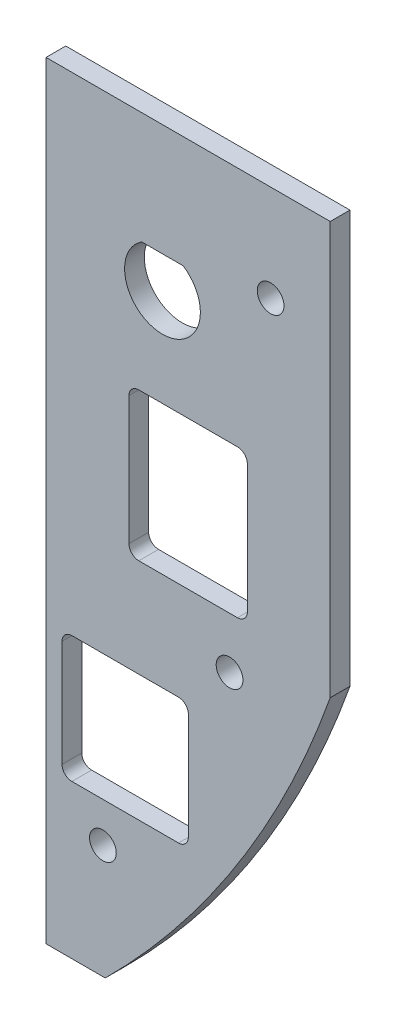
ISO-10303-21;
HEADER;
FILE_DESCRIPTION(('STEP AP214'),'2;1');
FILE_NAME('part.step','',(''),(''),'','','');
FILE_SCHEMA(('AUTOMOTIVE_DESIGN { 1 0 10303 214 1 1 1 1 }'));
ENDSEC;
DATA;
#1=APPLICATION_CONTEXT('core data for automotive mechanical design processes');
#2=APPLICATION_PROTOCOL_DEFINITION('international standard','automotive_design',2000,#1);
#3=PRODUCT_CONTEXT('',#1,'mechanical');
#4=PRODUCT('Part','Part','',(#3));
#5=PRODUCT_RELATED_PRODUCT_CATEGORY('part','',(#4));
#6=PRODUCT_DEFINITION_FORMATION('','',#4);
#7=PRODUCT_DEFINITION_CONTEXT('part definition',#1,'design');
#8=PRODUCT_DEFINITION('design','',#6,#7);
#9=PRODUCT_DEFINITION_SHAPE('','',#8);
#10=(LENGTH_UNIT() NAMED_UNIT(*) SI_UNIT(.MILLI.,.METRE.));
#11=(NAMED_UNIT(*) PLANE_ANGLE_UNIT() SI_UNIT($,.RADIAN.));
#12=(NAMED_UNIT(*) SI_UNIT($,.STERADIAN.) SOLID_ANGLE_UNIT());
#13=UNCERTAINTY_MEASURE_WITH_UNIT(LENGTH_MEASURE(1.E-05),#10,'distance_accuracy_value','');
#14=(GEOMETRIC_REPRESENTATION_CONTEXT(3) GLOBAL_UNCERTAINTY_ASSIGNED_CONTEXT((#13)) GLOBAL_UNIT_ASSIGNED_CONTEXT((#10,
#11,#12)) REPRESENTATION_CONTEXT('',''));
#15=CARTESIAN_POINT('',(0.,0.,0.));
#16=DIRECTION('',(0.,0.,1.));
#17=DIRECTION('',(1.,0.,0.));
#18=AXIS2_PLACEMENT_3D('',#15,#16,#17);
#19=CARTESIAN_POINT('',(45.7199999999999,-17.7800000000035,-3.17499999999971));
#20=DIRECTION('',(0.,1.,0.));
#21=DIRECTION('',(-1.,0.,0.));
#22=AXIS2_PLACEMENT_3D('',#19,#20,#21);
#23=PLANE('',#22);
#24=DIRECTION('',(-1.,0.,0.));
#25=VECTOR('',#24,1.);
#26=CARTESIAN_POINT('',(45.7199999999999,-17.7800000000006,-2.66453525910038E-12));
#27=LINE('',#26,#25);
#28=CARTESIAN_POINT('',(45.7199999999999,-17.7800000000006,-2.66453525910038E-12));
#29=VERTEX_POINT('',#28);
#30=CARTESIAN_POINT('',(0.,-17.7800000000006,-2.66453525910038E-12));
#31=VERTEX_POINT('',#30);
#32=EDGE_CURVE('E220',#29,#31,#27,.T.);
#33=ORIENTED_EDGE('',*,*,#32,.F.);
#34=DIRECTION('',(0.,0.,1.));
#35=VECTOR('',#34,1.);
#36=CARTESIAN_POINT('',(45.7199999999999,-17.7800000000035,-3.17499999999971));
#37=LINE('',#36,#35);
#38=CARTESIAN_POINT('',(45.7199999999999,-17.7800000000035,-3.17499999999971));
#39=VERTEX_POINT('',#38);
#40=EDGE_CURVE('E252',#39,#29,#37,.T.);
#41=ORIENTED_EDGE('',*,*,#40,.F.);
#42=DIRECTION('',(-1.,0.,0.));
#43=VECTOR('',#42,1.);
#44=CARTESIAN_POINT('',(45.7199999999999,-17.7800000000035,-3.17499999999971));
#45=LINE('',#44,#43);
#46=CARTESIAN_POINT('',(0.,-17.7800000000035,-3.17499999999971));
#47=VERTEX_POINT('',#46);
#48=EDGE_CURVE('E222',#39,#47,#45,.T.);
#49=ORIENTED_EDGE('',*,*,#48,.T.);
#50=DIRECTION('',(0.,0.,1.));
#51=VECTOR('',#50,1.);
#52=CARTESIAN_POINT('',(0.,-17.7800000000035,-3.17499999999971));
#53=LINE('',#52,#51);
#54=EDGE_CURVE('E238',#47,#31,#53,.T.);
#55=ORIENTED_EDGE('',*,*,#54,.T.);
#56=EDGE_LOOP('',(#33,#41,#49,#55));
#57=FACE_BOUND('',#56,.T.);
#58=ADVANCED_FACE('F36',(#57),#23,.T.);
#59=CARTESIAN_POINT('',(45.719999999998,-84.1375000000015,-3.17499999999793));
#60=DIRECTION('',(1.,0.,0.));
#61=DIRECTION('',(0.,0.,-1.));
#62=AXIS2_PLACEMENT_3D('',#59,#60,#61);
#63=PLANE('',#62);
#64=DIRECTION('',(0.,1.,0.));
#65=VECTOR('',#64,1.);
#66=CARTESIAN_POINT('',(45.719999999998,-84.1375000000002,0.));
#67=LINE('',#66,#65);
#68=CARTESIAN_POINT('',(45.719999999998,-84.1375000000002,0.));
#69=VERTEX_POINT('',#68);
#70=EDGE_CURVE('E226',#69,#29,#67,.T.);
#71=ORIENTED_EDGE('',*,*,#70,.F.);
#72=DIRECTION('',(0.,0.,1.));
#73=VECTOR('',#72,1.);
#74=CARTESIAN_POINT('',(45.719999999998,-84.1375000000015,-3.17499999999793));
#75=LINE('',#74,#73);
#76=CARTESIAN_POINT('',(45.719999999998,-84.1375000000015,-3.17499999999793));
#77=VERTEX_POINT('',#76);
#78=EDGE_CURVE('E255',#77,#69,#75,.T.);
#79=ORIENTED_EDGE('',*,*,#78,.F.);
#80=DIRECTION('',(0.,1.,0.));
#81=VECTOR('',#80,1.);
#82=CARTESIAN_POINT('',(45.719999999998,-84.1375000000015,-3.17499999999793));
#83=LINE('',#82,#81);
#84=EDGE_CURVE('E235',#77,#39,#83,.T.);
#85=ORIENTED_EDGE('',*,*,#84,.T.);
#86=ORIENTED_EDGE('',*,*,#40,.T.);
#87=EDGE_LOOP('',(#71,#79,#85,#86));
#88=FACE_BOUND('',#87,.T.);
#89=ADVANCED_FACE('F382',(#88),#63,.T.);
#90=CARTESIAN_POINT('',(-97.9169036036421,-33.2042110510289,-3.17499999999793));
#91=DIRECTION('',(0.,0.,1.));
#92=DIRECTION('',(1.,0.,0.));
#93=AXIS2_PLACEMENT_3D('',#90,#91,#92);
#94=CYLINDRICAL_SURFACE('',#93,152.400000000004);
#95=CARTESIAN_POINT('',(-97.9169036036421,-33.2042110510318,-1.24344978758018E-11));
#96=DIRECTION('',(0.,0.,1.));
#97=DIRECTION('',(1.,0.,0.));
#98=AXIS2_PLACEMENT_3D('',#95,#96,#97);
#99=CIRCLE('',#98,152.400000000004);
#100=CARTESIAN_POINT('',(9.52499999999801,-141.287500000003,0.));
#101=VERTEX_POINT('',#100);
#102=EDGE_CURVE('E247',#101,#69,#99,.T.);
#103=ORIENTED_EDGE('',*,*,#102,.F.);
#104=DIRECTION('',(0.,0.,1.));
#105=VECTOR('',#104,1.);
#106=CARTESIAN_POINT('',(9.52499999999801,-141.287500000001,-3.17499999999971));
#107=LINE('',#106,#105);
#108=CARTESIAN_POINT('',(9.52499999999801,-141.287500000001,-3.17499999999971));
#109=VERTEX_POINT('',#108);
#110=EDGE_CURVE('E257',#109,#101,#107,.T.);
#111=ORIENTED_EDGE('',*,*,#110,.F.);
#112=CARTESIAN_POINT('',(-97.9169036036421,-33.2042110510289,-3.17499999999793));
#113=DIRECTION('',(0.,0.,1.));
#114=DIRECTION('',(1.,0.,0.));
#115=AXIS2_PLACEMENT_3D('',#112,#113,#114);
#116=CIRCLE('',#115,152.400000000004);
#117=EDGE_CURVE('E232',#109,#77,#116,.T.);
#118=ORIENTED_EDGE('',*,*,#117,.T.);
#119=ORIENTED_EDGE('',*,*,#78,.T.);
#120=EDGE_LOOP('',(#103,#111,#118,#119));
#121=FACE_BOUND('',#120,.T.);
#122=ADVANCED_FACE('F388',(#121),#94,.T.);
#123=CARTESIAN_POINT('',(-1.94289029309402E-12,-141.287500000001,-3.17499999999971));
#124=DIRECTION('',(0.,-1.,0.));
#125=DIRECTION('',(0.,0.,-1.));
#126=AXIS2_PLACEMENT_3D('',#123,#124,#125);
#127=PLANE('',#126);
#128=DIRECTION('',(1.,0.,0.));
#129=VECTOR('',#128,1.);
#130=CARTESIAN_POINT('',(-1.94289029309402E-12,-141.287500000003,0.));
#131=LINE('',#130,#129);
#132=CARTESIAN_POINT('',(-1.94289029309402E-12,-141.287500000003,0.));
#133=VERTEX_POINT('',#132);
#134=EDGE_CURVE('E244',#133,#101,#131,.T.);
#135=ORIENTED_EDGE('',*,*,#134,.F.);
#136=DIRECTION('',(0.,0.,1.));
#137=VECTOR('',#136,1.);
#138=CARTESIAN_POINT('',(-1.94289029309402E-12,-141.287500000001,-3.17499999999971));
#139=LINE('',#138,#137);
#140=CARTESIAN_POINT('',(-1.94289029309402E-12,-141.287500000001,-3.17499999999971));
#141=VERTEX_POINT('',#140);
#142=EDGE_CURVE('E259',#141,#133,#139,.T.);
#143=ORIENTED_EDGE('',*,*,#142,.F.);
#144=DIRECTION('',(1.,0.,0.));
#145=VECTOR('',#144,1.);
#146=CARTESIAN_POINT('',(-1.94289029309402E-12,-141.287500000001,-3.17499999999971));
#147=LINE('',#146,#145);
#148=EDGE_CURVE('E229',#141,#109,#147,.T.);
#149=ORIENTED_EDGE('',*,*,#148,.T.);
#150=ORIENTED_EDGE('',*,*,#110,.T.);
#151=EDGE_LOOP('',(#135,#143,#149,#150));
#152=FACE_BOUND('',#151,.T.);
#153=ADVANCED_FACE('F445',(#152),#127,.T.);
#154=CARTESIAN_POINT('',(0.,-17.7800000000035,-3.17499999999971));
#155=DIRECTION('',(-1.,0.,0.));
#156=DIRECTION('',(0.,-1.,0.));
#157=AXIS2_PLACEMENT_3D('',#154,#155,#156);
#158=PLANE('',#157);
#159=DIRECTION('',(0.,-1.,0.));
#160=VECTOR('',#159,1.);
#161=CARTESIAN_POINT('',(0.,-17.7800000000006,-2.66453525910038E-12));
#162=LINE('',#161,#160);
#163=EDGE_CURVE('E241',#31,#133,#162,.T.);
#164=ORIENTED_EDGE('',*,*,#163,.F.);
#165=ORIENTED_EDGE('',*,*,#54,.F.);
#166=DIRECTION('',(0.,-1.,0.));
#167=VECTOR('',#166,1.);
#168=CARTESIAN_POINT('',(0.,-17.7800000000035,-3.17499999999971));
#169=LINE('',#168,#167);
#170=EDGE_CURVE('E225',#47,#141,#169,.T.);
#171=ORIENTED_EDGE('',*,*,#170,.T.);
#172=ORIENTED_EDGE('',*,*,#142,.T.);
#173=EDGE_LOOP('',(#164,#165,#171,#172));
#174=FACE_BOUND('',#173,.T.);
#175=ADVANCED_FACE('F394',(#174),#158,.T.);
#176=CARTESIAN_POINT('',(-97.9169036036421,-33.2042110510289,-3.17499999999793));
#177=DIRECTION('',(0.,0.,1.));
#178=DIRECTION('',(1.,0.,0.));
#179=AXIS2_PLACEMENT_3D('',#176,#177,#178);
#180=PLANE('',#179);
#181=CARTESIAN_POINT('',(9.14399999999804,-122.999500000001,-3.17500000000148));
#182=DIRECTION('',(0.,0.,1.));
#183=DIRECTION('',(1.,0.,0.));
#184=AXIS2_PLACEMENT_3D('',#181,#182,#183);
#185=CIRCLE('',#184,2.15265);
#186=CARTESIAN_POINT('',(11.296649999998,-122.999500000001,-3.17500000000147));
#187=VERTEX_POINT('',#186);
#188=EDGE_CURVE('E616',#187,#187,#185,.T.);
#189=ORIENTED_EDGE('',*,*,#188,.T.);
#190=EDGE_LOOP('',(#189));
#191=FACE_BOUND('',#190,.T.);
#192=CARTESIAN_POINT('',(29.527499999998,-88.7095000000002,-3.17499999999971));
#193=DIRECTION('',(0.,0.,1.));
#194=DIRECTION('',(1.,0.,0.));
#195=AXIS2_PLACEMENT_3D('',#192,#193,#194);
#196=CIRCLE('',#195,2.15265);
#197=CARTESIAN_POINT('',(31.680149999998,-88.7095000000002,-3.1749999999997));
#198=VERTEX_POINT('',#197);
#199=EDGE_CURVE('E626',#198,#198,#196,.T.);
#200=ORIENTED_EDGE('',*,*,#199,.T.);
#201=EDGE_LOOP('',(#200));
#202=FACE_BOUND('',#201,.T.);
#203=CARTESIAN_POINT('',(36.131499999998,-33.274,-3.17499999999971));
#204=DIRECTION('',(0.,0.,1.));
#205=DIRECTION('',(1.,0.,0.));
#206=AXIS2_PLACEMENT_3D('',#203,#204,#205);
#207=CIRCLE('',#206,2.15264999999999);
#208=CARTESIAN_POINT('',(38.284149999998,-33.274,-3.1749999999997));
#209=VERTEX_POINT('',#208);
#210=EDGE_CURVE('E632',#209,#209,#207,.T.);
#211=ORIENTED_EDGE('',*,*,#210,.T.);
#212=EDGE_LOOP('',(#211));
#213=FACE_BOUND('',#212,.T.);
#214=DIRECTION('',(0.,-1.,0.));
#215=VECTOR('',#214,1.);
#216=CARTESIAN_POINT('',(2.57172210773876,-116.58254494914,-3.17499999999971));
#217=LINE('',#216,#215);
#218=CARTESIAN_POINT('',(2.57172210773876,-97.8500449491415,-3.1749999999926));
#219=VERTEX_POINT('',#218);
#220=CARTESIAN_POINT('',(2.57172210773876,-114.995044949143,-3.17499999999971));
#221=VERTEX_POINT('',#220);
#222=EDGE_CURVE('E643',#219,#221,#217,.T.);
#223=ORIENTED_EDGE('',*,*,#222,.T.);
#224=CARTESIAN_POINT('',(4.15922210773878,-114.995044949143,-3.17499999999971));
#225=DIRECTION('',(0.,0.,1.));
#226=DIRECTION('',(1.,0.,0.));
#227=AXIS2_PLACEMENT_3D('',#224,#225,#226);
#228=CIRCLE('',#227,1.5875);
#229=CARTESIAN_POINT('',(4.15922210773878,-116.58254494914,-3.17499999999971));
#230=VERTEX_POINT('',#229);
#231=EDGE_CURVE('E302',#221,#230,#228,.T.);
#232=ORIENTED_EDGE('',*,*,#231,.T.);
#233=DIRECTION('',(1.,0.,0.));
#234=VECTOR('',#233,1.);
#235=CARTESIAN_POINT('',(22.8917221077388,-116.58254494914,-3.17499999999971));
#236=LINE('',#235,#234);
#237=CARTESIAN_POINT('',(21.3042221077387,-116.58254494914,-3.17499999999971));
#238=VERTEX_POINT('',#237);
#239=EDGE_CURVE('E338',#230,#238,#236,.T.);
#240=ORIENTED_EDGE('',*,*,#239,.T.);
#241=CARTESIAN_POINT('',(21.3042221077387,-114.995044949143,-3.17499999999971));
#242=DIRECTION('',(0.,0.,1.));
#243=DIRECTION('',(1.,0.,0.));
#244=AXIS2_PLACEMENT_3D('',#241,#242,#243);
#245=CIRCLE('',#244,1.5875);
#246=CARTESIAN_POINT('',(22.8917221077388,-114.995044949143,-3.17499999999971));
#247=VERTEX_POINT('',#246);
#248=EDGE_CURVE('E306',#238,#247,#245,.T.);
#249=ORIENTED_EDGE('',*,*,#248,.T.);
#250=DIRECTION('',(0.,1.,0.));
#251=VECTOR('',#250,1.);
#252=CARTESIAN_POINT('',(22.8917221077388,-116.58254494914,-3.17499999999971));
#253=LINE('',#252,#251);
#254=CARTESIAN_POINT('',(22.8917221077388,-97.8500449491415,-3.1749999999926));
#255=VERTEX_POINT('',#254);
#256=EDGE_CURVE('E636',#247,#255,#253,.T.);
#257=ORIENTED_EDGE('',*,*,#256,.T.);
#258=CARTESIAN_POINT('',(21.3042221077387,-97.8500449491415,-3.1749999999926));
#259=DIRECTION('',(0.,0.,1.));
#260=DIRECTION('',(1.,0.,0.));
#261=AXIS2_PLACEMENT_3D('',#258,#259,#260);
#262=CIRCLE('',#261,1.5875);
#263=CARTESIAN_POINT('',(21.3042221077387,-96.2625449491421,-3.17499999999971));
#264=VERTEX_POINT('',#263);
#265=EDGE_CURVE('E310',#255,#264,#262,.T.);
#266=ORIENTED_EDGE('',*,*,#265,.T.);
#267=DIRECTION('',(-1.,0.,0.));
#268=VECTOR('',#267,1.);
#269=CARTESIAN_POINT('',(22.8917221077388,-96.2625449491421,-3.17499999999971));
#270=LINE('',#269,#268);
#271=CARTESIAN_POINT('',(4.15922210773878,-96.2625449491421,-3.17499999999971));
#272=VERTEX_POINT('',#271);
#273=EDGE_CURVE('E639',#264,#272,#270,.T.);
#274=ORIENTED_EDGE('',*,*,#273,.T.);
#275=CARTESIAN_POINT('',(4.15922210773878,-97.8500449491415,-3.1749999999926));
#276=DIRECTION('',(0.,0.,1.));
#277=DIRECTION('',(1.,0.,0.));
#278=AXIS2_PLACEMENT_3D('',#275,#276,#277);
#279=CIRCLE('',#278,1.5875);
#280=EDGE_CURVE('E314',#272,#219,#279,.T.);
#281=ORIENTED_EDGE('',*,*,#280,.T.);
#282=EDGE_LOOP('',(#223,#232,#240,#249,#257,#266,#274,#281));
#283=FACE_BOUND('',#282,.T.);
#284=DIRECTION('',(0.,1.,0.));
#285=VECTOR('',#284,1.);
#286=CARTESIAN_POINT('',(32.384999999998,-56.6420000000016,-3.17499999999971));
#287=LINE('',#286,#285);
#288=CARTESIAN_POINT('',(32.384999999998,-78.8670000000002,-3.17499999999971));
#289=VERTEX_POINT('',#288);
#290=CARTESIAN_POINT('',(32.384999999998,-58.2294999999995,-3.17500000000059));
#291=VERTEX_POINT('',#290);
#292=EDGE_CURVE('E350',#289,#291,#287,.T.);
#293=ORIENTED_EDGE('',*,*,#292,.T.);
#294=CARTESIAN_POINT('',(30.797499999998,-58.2294999999995,-3.17500000000059));
#295=DIRECTION('',(0.,0.,1.));
#296=DIRECTION('',(1.,0.,0.));
#297=AXIS2_PLACEMENT_3D('',#294,#295,#296);
#298=CIRCLE('',#297,1.5875);
#299=CARTESIAN_POINT('',(30.797499999998,-56.6420000000016,-3.17499999999971));
#300=VERTEX_POINT('',#299);
#301=EDGE_CURVE('E318',#291,#300,#298,.T.);
#302=ORIENTED_EDGE('',*,*,#301,.T.);
#303=DIRECTION('',(-1.,0.,0.));
#304=VECTOR('',#303,1.);
#305=CARTESIAN_POINT('',(13.334999999998,-56.6420000000016,-3.17499999999971));
#306=LINE('',#305,#304);
#307=CARTESIAN_POINT('',(14.922499999998,-56.6420000000016,-3.17499999999971));
#308=VERTEX_POINT('',#307);
#309=EDGE_CURVE('E218',#300,#308,#306,.T.);
#310=ORIENTED_EDGE('',*,*,#309,.T.);
#311=CARTESIAN_POINT('',(14.922499999998,-58.2294999999995,-3.17500000000059));
#312=DIRECTION('',(0.,0.,1.));
#313=DIRECTION('',(1.,0.,0.));
#314=AXIS2_PLACEMENT_3D('',#311,#312,#313);
#315=CIRCLE('',#314,1.5875);
#316=CARTESIAN_POINT('',(13.334999999998,-58.2294999999995,-3.17500000000059));
#317=VERTEX_POINT('',#316);
#318=EDGE_CURVE('E58',#308,#317,#315,.T.);
#319=ORIENTED_EDGE('',*,*,#318,.T.);
#320=DIRECTION('',(0.,-1.,0.));
#321=VECTOR('',#320,1.);
#322=CARTESIAN_POINT('',(13.334999999998,-56.6420000000016,-3.17499999999971));
#323=LINE('',#322,#321);
#324=CARTESIAN_POINT('',(13.334999999998,-78.8670000000002,-3.17499999999971));
#325=VERTEX_POINT('',#324);
#326=EDGE_CURVE('E346',#317,#325,#323,.T.);
#327=ORIENTED_EDGE('',*,*,#326,.T.);
#328=CARTESIAN_POINT('',(14.922499999998,-78.8670000000002,-3.17499999999971));
#329=DIRECTION('',(0.,0.,1.));
#330=DIRECTION('',(1.,0.,0.));
#331=AXIS2_PLACEMENT_3D('',#328,#329,#330);
#332=CIRCLE('',#331,1.5875);
#333=CARTESIAN_POINT('',(14.922499999998,-80.4545000000014,-3.17499999999971));
#334=VERTEX_POINT('',#333);
#335=EDGE_CURVE('E11',#325,#334,#332,.T.);
#336=ORIENTED_EDGE('',*,*,#335,.T.);
#337=DIRECTION('',(1.,0.,0.));
#338=VECTOR('',#337,1.);
#339=CARTESIAN_POINT('',(13.334999999998,-80.4545000000014,-3.17499999999971));
#340=LINE('',#339,#338);
#341=CARTESIAN_POINT('',(30.797499999998,-80.4545000000014,-3.17499999999971));
#342=VERTEX_POINT('',#341);
#343=EDGE_CURVE('E344',#334,#342,#340,.T.);
#344=ORIENTED_EDGE('',*,*,#343,.T.);
#345=CARTESIAN_POINT('',(30.797499999998,-78.8670000000002,-3.17499999999971));
#346=DIRECTION('',(0.,0.,1.));
#347=DIRECTION('',(1.,0.,0.));
#348=AXIS2_PLACEMENT_3D('',#345,#346,#347);
#349=CIRCLE('',#348,1.5875);
#350=EDGE_CURVE('E322',#342,#289,#349,.T.);
#351=ORIENTED_EDGE('',*,*,#350,.T.);
#352=EDGE_LOOP('',(#293,#302,#310,#319,#327,#336,#344,#351));
#353=FACE_BOUND('',#352,.T.);
#354=DIRECTION('',(-1.,0.,0.));
#355=VECTOR('',#354,1.);
#356=CARTESIAN_POINT('',(15.4014180676523,-35.7886000000034,-3.17499999999793));
#357=LINE('',#356,#355);
#358=CARTESIAN_POINT('',(22.0635819323437,-35.7886000000034,-3.17499999999793));
#359=VERTEX_POINT('',#358);
#360=CARTESIAN_POINT('',(15.4014180676523,-35.7886000000034,-3.17499999999793));
#361=VERTEX_POINT('',#360);
#362=EDGE_CURVE('E203',#359,#361,#357,.T.);
#363=ORIENTED_EDGE('',*,*,#362,.T.);
#364=CARTESIAN_POINT('',(18.732499999998,-40.8940000000009,-3.17499999999526));
#365=DIRECTION('',(0.,0.,1.));
#366=DIRECTION('',(1.,0.,0.));
#367=AXIS2_PLACEMENT_3D('',#364,#365,#366);
#368=CIRCLE('',#367,6.096);
#369=EDGE_CURVE('E195',#361,#359,#368,.T.);
#370=ORIENTED_EDGE('',*,*,#369,.T.);
#371=EDGE_LOOP('',(#363,#370));
#372=FACE_BOUND('',#371,.T.);
#373=ORIENTED_EDGE('',*,*,#48,.F.);
#374=ORIENTED_EDGE('',*,*,#84,.F.);
#375=ORIENTED_EDGE('',*,*,#117,.F.);
#376=ORIENTED_EDGE('',*,*,#148,.F.);
#377=ORIENTED_EDGE('',*,*,#170,.F.);
#378=EDGE_LOOP('',(#373,#374,#375,#376,#377));
#379=FACE_BOUND('',#378,.T.);
#380=ADVANCED_FACE('F209',(#191,#202,#213,#283,#353,#372,#379),#180,.F.);
#381=CARTESIAN_POINT('',(-97.9169036036421,-33.2042110510318,-1.24344978758018E-11));
#382=DIRECTION('',(0.,0.,1.));
#383=DIRECTION('',(1.,0.,0.));
#384=AXIS2_PLACEMENT_3D('',#381,#382,#383);
#385=PLANE('',#384);
#386=CARTESIAN_POINT('',(9.14399999999804,-122.999500000002,5.32907051820075E-12));
#387=DIRECTION('',(0.,0.,1.));
#388=DIRECTION('',(1.,0.,0.));
#389=AXIS2_PLACEMENT_3D('',#386,#387,#388);
#390=CIRCLE('',#389,2.15265);
#391=CARTESIAN_POINT('',(11.296649999998,-122.999500000002,5.33802127987882E-12));
#392=VERTEX_POINT('',#391);
#393=EDGE_CURVE('E619',#392,#392,#390,.T.);
#394=ORIENTED_EDGE('',*,*,#393,.F.);
#395=EDGE_LOOP('',(#394));
#396=FACE_BOUND('',#395,.T.);
#397=CARTESIAN_POINT('',(29.527499999998,-88.7094999999993,7.99360577730113E-12));
#398=DIRECTION('',(0.,0.,1.));
#399=DIRECTION('',(1.,0.,0.));
#400=AXIS2_PLACEMENT_3D('',#397,#398,#399);
#401=CIRCLE('',#400,2.15265);
#402=CARTESIAN_POINT('',(31.680149999998,-88.7094999999993,8.00255653897919E-12));
#403=VERTEX_POINT('',#402);
#404=EDGE_CURVE('E621',#403,#403,#401,.T.);
#405=ORIENTED_EDGE('',*,*,#404,.F.);
#406=EDGE_LOOP('',(#405));
#407=FACE_BOUND('',#406,.T.);
#408=CARTESIAN_POINT('',(36.1315,-33.2740000000005,-8.88178419700125E-13));
#409=DIRECTION('',(0.,0.,1.));
#410=DIRECTION('',(1.,0.,0.));
#411=AXIS2_PLACEMENT_3D('',#408,#409,#410);
#412=CIRCLE('',#411,2.15264999999999);
#413=CARTESIAN_POINT('',(38.28415,-33.2740000000005,-8.79227658022058E-13));
#414=VERTEX_POINT('',#413);
#415=EDGE_CURVE('E629',#414,#414,#412,.T.);
#416=ORIENTED_EDGE('',*,*,#415,.F.);
#417=EDGE_LOOP('',(#416));
#418=FACE_BOUND('',#417,.T.);
#419=DIRECTION('',(0.,1.,0.));
#420=VECTOR('',#419,1.);
#421=CARTESIAN_POINT('',(22.8917221077388,-116.582544949141,-8.88178419700125E-13));
#422=LINE('',#421,#420);
#423=CARTESIAN_POINT('',(22.8917221077388,-114.995044949143,-2.66453525910038E-12));
#424=VERTEX_POINT('',#423);
#425=CARTESIAN_POINT('',(22.8917221077388,-97.850044949142,-6.21724893790088E-12));
#426=VERTEX_POINT('',#425);
#427=EDGE_CURVE('E635',#424,#426,#422,.T.);
#428=ORIENTED_EDGE('',*,*,#427,.F.);
#429=CARTESIAN_POINT('',(21.3042221077387,-114.995044949143,-2.66453525910038E-12));
#430=DIRECTION('',(0.,0.,1.));
#431=DIRECTION('',(1.,0.,0.));
#432=AXIS2_PLACEMENT_3D('',#429,#430,#431);
#433=CIRCLE('',#432,1.5875);
#434=CARTESIAN_POINT('',(21.3042221077387,-116.582544949141,-8.88178419700125E-13));
#435=VERTEX_POINT('',#434);
#436=EDGE_CURVE('E304',#424,#435,#433,.F.);
#437=ORIENTED_EDGE('',*,*,#436,.T.);
#438=DIRECTION('',(1.,0.,0.));
#439=VECTOR('',#438,1.);
#440=CARTESIAN_POINT('',(22.8917221077388,-116.582544949141,-8.88178419700125E-13));
#441=LINE('',#440,#439);
#442=CARTESIAN_POINT('',(4.15922210773878,-116.582544949141,-8.88178419700125E-13));
#443=VERTEX_POINT('',#442);
#444=EDGE_CURVE('E640',#443,#435,#441,.T.);
#445=ORIENTED_EDGE('',*,*,#444,.F.);
#446=CARTESIAN_POINT('',(4.15922210773878,-114.995044949143,-2.66453525910038E-12));
#447=DIRECTION('',(0.,0.,1.));
#448=DIRECTION('',(1.,0.,0.));
#449=AXIS2_PLACEMENT_3D('',#446,#447,#448);
#450=CIRCLE('',#449,1.5875);
#451=CARTESIAN_POINT('',(2.57172210773876,-114.995044949143,-2.66453525910038E-12));
#452=VERTEX_POINT('',#451);
#453=EDGE_CURVE('E300',#443,#452,#450,.F.);
#454=ORIENTED_EDGE('',*,*,#453,.T.);
#455=DIRECTION('',(0.,-1.,0.));
#456=VECTOR('',#455,1.);
#457=CARTESIAN_POINT('',(2.57172210773876,-116.582544949141,-8.88178419700125E-13));
#458=LINE('',#457,#456);
#459=CARTESIAN_POINT('',(2.57172210773876,-97.850044949142,-6.21724893790088E-12));
#460=VERTEX_POINT('',#459);
#461=EDGE_CURVE('E653',#460,#452,#458,.T.);
#462=ORIENTED_EDGE('',*,*,#461,.F.);
#463=CARTESIAN_POINT('',(4.15922210773878,-97.850044949142,-6.21724893790088E-12));
#464=DIRECTION('',(0.,0.,1.));
#465=DIRECTION('',(1.,0.,0.));
#466=AXIS2_PLACEMENT_3D('',#463,#464,#465);
#467=CIRCLE('',#466,1.5875);
#468=CARTESIAN_POINT('',(4.15922210773878,-96.2625449491412,0.));
#469=VERTEX_POINT('',#468);
#470=EDGE_CURVE('E312',#460,#469,#467,.F.);
#471=ORIENTED_EDGE('',*,*,#470,.T.);
#472=DIRECTION('',(-1.,0.,0.));
#473=VECTOR('',#472,1.);
#474=CARTESIAN_POINT('',(22.8917221077388,-96.2625449491412,0.));
#475=LINE('',#474,#473);
#476=CARTESIAN_POINT('',(21.3042221077387,-96.2625449491412,0.));
#477=VERTEX_POINT('',#476);
#478=EDGE_CURVE('E650',#477,#469,#475,.T.);
#479=ORIENTED_EDGE('',*,*,#478,.F.);
#480=CARTESIAN_POINT('',(21.3042221077387,-97.850044949142,-6.21724893790088E-12));
#481=DIRECTION('',(0.,0.,1.));
#482=DIRECTION('',(1.,0.,0.));
#483=AXIS2_PLACEMENT_3D('',#480,#481,#482);
#484=CIRCLE('',#483,1.5875);
#485=EDGE_CURVE('E308',#477,#426,#484,.F.);
#486=ORIENTED_EDGE('',*,*,#485,.T.);
#487=EDGE_LOOP('',(#428,#437,#445,#454,#462,#471,#479,#486));
#488=FACE_BOUND('',#487,.T.);
#489=DIRECTION('',(0.,-1.,0.));
#490=VECTOR('',#489,1.);
#491=CARTESIAN_POINT('',(13.334999999998,-56.6420000000001,0.));
#492=LINE('',#491,#490);
#493=CARTESIAN_POINT('',(13.334999999998,-58.2295000000028,5.32907051820075E-12));
#494=VERTEX_POINT('',#493);
#495=CARTESIAN_POINT('',(13.334999999998,-78.8670000000007,0.));
#496=VERTEX_POINT('',#495);
#497=EDGE_CURVE('E331',#494,#496,#492,.T.);
#498=ORIENTED_EDGE('',*,*,#497,.F.);
#499=CARTESIAN_POINT('',(14.922499999998,-58.2295000000028,5.32907051820075E-12));
#500=DIRECTION('',(0.,0.,1.));
#501=DIRECTION('',(1.,0.,0.));
#502=AXIS2_PLACEMENT_3D('',#499,#500,#501);
#503=CIRCLE('',#502,1.5875);
#504=CARTESIAN_POINT('',(14.922499999998,-56.6420000000001,0.));
#505=VERTEX_POINT('',#504);
#506=EDGE_CURVE('E324',#494,#505,#503,.F.);
#507=ORIENTED_EDGE('',*,*,#506,.T.);
#508=DIRECTION('',(-1.,0.,0.));
#509=VECTOR('',#508,1.);
#510=CARTESIAN_POINT('',(13.334999999998,-56.6420000000001,0.));
#511=LINE('',#510,#509);
#512=CARTESIAN_POINT('',(30.797499999998,-56.6420000000001,0.));
#513=VERTEX_POINT('',#512);
#514=EDGE_CURVE('E215',#513,#505,#511,.T.);
#515=ORIENTED_EDGE('',*,*,#514,.F.);
#516=CARTESIAN_POINT('',(30.797499999998,-58.2295000000028,5.32907051820075E-12));
#517=DIRECTION('',(0.,0.,1.));
#518=DIRECTION('',(1.,0.,0.));
#519=AXIS2_PLACEMENT_3D('',#516,#517,#518);
#520=CIRCLE('',#519,1.5875);
#521=CARTESIAN_POINT('',(32.384999999998,-58.2295000000028,5.32907051820075E-12));
#522=VERTEX_POINT('',#521);
#523=EDGE_CURVE('E316',#513,#522,#520,.F.);
#524=ORIENTED_EDGE('',*,*,#523,.T.);
#525=DIRECTION('',(0.,1.,0.));
#526=VECTOR('',#525,1.);
#527=CARTESIAN_POINT('',(32.384999999998,-56.6420000000001,0.));
#528=LINE('',#527,#526);
#529=CARTESIAN_POINT('',(32.384999999998,-78.8670000000007,0.));
#530=VERTEX_POINT('',#529);
#531=EDGE_CURVE('E357',#530,#522,#528,.T.);
#532=ORIENTED_EDGE('',*,*,#531,.F.);
#533=CARTESIAN_POINT('',(30.797499999998,-78.8670000000007,0.));
#534=DIRECTION('',(0.,0.,1.));
#535=DIRECTION('',(1.,0.,0.));
#536=AXIS2_PLACEMENT_3D('',#533,#534,#535);
#537=CIRCLE('',#536,1.5875);
#538=CARTESIAN_POINT('',(30.797499999998,-80.4545000000005,0.));
#539=VERTEX_POINT('',#538);
#540=EDGE_CURVE('E320',#530,#539,#537,.F.);
#541=ORIENTED_EDGE('',*,*,#540,.T.);
#542=DIRECTION('',(1.,0.,0.));
#543=VECTOR('',#542,1.);
#544=CARTESIAN_POINT('',(13.334999999998,-80.4545000000005,0.));
#545=LINE('',#544,#543);
#546=CARTESIAN_POINT('',(14.922499999998,-80.4545000000005,0.));
#547=VERTEX_POINT('',#546);
#548=EDGE_CURVE('E333',#547,#539,#545,.T.);
#549=ORIENTED_EDGE('',*,*,#548,.F.);
#550=CARTESIAN_POINT('',(14.922499999998,-78.8670000000007,0.));
#551=DIRECTION('',(0.,0.,1.));
#552=DIRECTION('',(1.,0.,0.));
#553=AXIS2_PLACEMENT_3D('',#550,#551,#552);
#554=CIRCLE('',#553,1.5875);
#555=EDGE_CURVE('E44',#547,#496,#554,.F.);
#556=ORIENTED_EDGE('',*,*,#555,.T.);
#557=EDGE_LOOP('',(#498,#507,#515,#524,#532,#541,#549,#556));
#558=FACE_BOUND('',#557,.T.);
#559=CARTESIAN_POINT('',(18.732499999998,-40.894,0.));
#560=DIRECTION('',(0.,0.,1.));
#561=DIRECTION('',(1.,0.,0.));
#562=AXIS2_PLACEMENT_3D('',#559,#560,#561);
#563=CIRCLE('',#562,6.096);
#564=CARTESIAN_POINT('',(15.4014180676523,-35.7886000000007,0.));
#565=VERTEX_POINT('',#564);
#566=CARTESIAN_POINT('',(22.0635819323437,-35.7886000000007,0.));
#567=VERTEX_POINT('',#566);
#568=EDGE_CURVE('E198',#565,#567,#563,.T.);
#569=ORIENTED_EDGE('',*,*,#568,.F.);
#570=DIRECTION('',(-1.,0.,0.));
#571=VECTOR('',#570,1.);
#572=CARTESIAN_POINT('',(15.4014180676523,-35.7886000000007,0.));
#573=LINE('',#572,#571);
#574=EDGE_CURVE('E211',#567,#565,#573,.T.);
#575=ORIENTED_EDGE('',*,*,#574,.F.);
#576=EDGE_LOOP('',(#569,#575));
#577=FACE_BOUND('',#576,.T.);
#578=ORIENTED_EDGE('',*,*,#32,.T.);
#579=ORIENTED_EDGE('',*,*,#163,.T.);
#580=ORIENTED_EDGE('',*,*,#134,.T.);
#581=ORIENTED_EDGE('',*,*,#102,.T.);
#582=ORIENTED_EDGE('',*,*,#70,.T.);
#583=EDGE_LOOP('',(#578,#579,#580,#581,#582));
#584=FACE_BOUND('',#583,.T.);
#585=ADVANCED_FACE('F329',(#396,#407,#418,#488,#558,#577,#584),#385,.T.);
#586=CARTESIAN_POINT('',(18.732499999998,-40.8940000000009,-3.17499999999526));
#587=DIRECTION('',(0.,0.,1.));
#588=DIRECTION('',(1.,0.,0.));
#589=AXIS2_PLACEMENT_3D('',#586,#587,#588);
#590=CYLINDRICAL_SURFACE('',#589,6.096);
#591=ORIENTED_EDGE('',*,*,#568,.T.);
#592=DIRECTION('',(0.,0.,1.));
#593=VECTOR('',#592,1.);
#594=CARTESIAN_POINT('',(22.0635819323437,-35.7886000000034,-3.17499999999793));
#595=LINE('',#594,#593);
#596=EDGE_CURVE('E191',#359,#567,#595,.T.);
#597=ORIENTED_EDGE('',*,*,#596,.F.);
#598=ORIENTED_EDGE('',*,*,#369,.F.);
#599=DIRECTION('',(0.,0.,1.));
#600=VECTOR('',#599,1.);
#601=CARTESIAN_POINT('',(15.4014180676523,-35.7886000000034,-3.17499999999793));
#602=LINE('',#601,#600);
#603=EDGE_CURVE('E202',#361,#565,#602,.T.);
#604=ORIENTED_EDGE('',*,*,#603,.T.);
#605=EDGE_LOOP('',(#591,#597,#598,#604));
#606=FACE_BOUND('',#605,.T.);
#607=ADVANCED_FACE('F193',(#606),#590,.F.);
#608=CARTESIAN_POINT('',(15.4014180676523,-35.7886000000034,-3.17499999999793));
#609=DIRECTION('',(0.,1.,0.));
#610=DIRECTION('',(-1.,0.,0.));
#611=AXIS2_PLACEMENT_3D('',#608,#609,#610);
#612=PLANE('',#611);
#613=ORIENTED_EDGE('',*,*,#574,.T.);
#614=ORIENTED_EDGE('',*,*,#603,.F.);
#615=ORIENTED_EDGE('',*,*,#362,.F.);
#616=ORIENTED_EDGE('',*,*,#596,.T.);
#617=EDGE_LOOP('',(#613,#614,#615,#616));
#618=FACE_BOUND('',#617,.T.);
#619=ADVANCED_FACE('F206',(#618),#612,.F.);
#620=CARTESIAN_POINT('',(13.334999999998,-56.6420000000016,-3.17499999999971));
#621=DIRECTION('',(-1.,0.,0.));
#622=DIRECTION('',(0.,0.,1.));
#623=AXIS2_PLACEMENT_3D('',#620,#621,#622);
#624=PLANE('',#623);
#625=ORIENTED_EDGE('',*,*,#326,.F.);
#626=DIRECTION('',(0.,0.,1.));
#627=VECTOR('',#626,1.);
#628=CARTESIAN_POINT('',(13.334999999998,-58.2295000000028,5.32907051820075E-12));
#629=LINE('',#628,#627);
#630=EDGE_CURVE('E297',#317,#494,#629,.T.);
#631=ORIENTED_EDGE('',*,*,#630,.T.);
#632=ORIENTED_EDGE('',*,*,#497,.T.);
#633=DIRECTION('',(0.,0.,1.));
#634=VECTOR('',#633,1.);
#635=CARTESIAN_POINT('',(13.334999999998,-78.8670000000002,-3.17499999999971));
#636=LINE('',#635,#634);
#637=EDGE_CURVE('E51',#496,#325,#636,.F.);
#638=ORIENTED_EDGE('',*,*,#637,.T.);
#639=EDGE_LOOP('',(#625,#631,#632,#638));
#640=FACE_BOUND('',#639,.T.);
#641=ADVANCED_FACE('F336',(#640),#624,.F.);
#642=CARTESIAN_POINT('',(13.334999999998,-56.6420000000016,-3.17499999999971));
#643=DIRECTION('',(0.,1.,0.));
#644=DIRECTION('',(0.,0.,1.));
#645=AXIS2_PLACEMENT_3D('',#642,#643,#644);
#646=PLANE('',#645);
#647=ORIENTED_EDGE('',*,*,#309,.F.);
#648=DIRECTION('',(0.,0.,1.));
#649=VECTOR('',#648,1.);
#650=CARTESIAN_POINT('',(30.797499999998,-56.6420000000001,0.));
#651=LINE('',#650,#649);
#652=EDGE_CURVE('E283',#300,#513,#651,.T.);
#653=ORIENTED_EDGE('',*,*,#652,.T.);
#654=ORIENTED_EDGE('',*,*,#514,.T.);
#655=DIRECTION('',(0.,0.,1.));
#656=VECTOR('',#655,1.);
#657=CARTESIAN_POINT('',(14.922499999998,-56.6420000000016,-3.17499999999971));
#658=LINE('',#657,#656);
#659=EDGE_CURVE('E281',#505,#308,#658,.F.);
#660=ORIENTED_EDGE('',*,*,#659,.T.);
#661=EDGE_LOOP('',(#647,#653,#654,#660));
#662=FACE_BOUND('',#661,.T.);
#663=ADVANCED_FACE('F367',(#662),#646,.F.);
#664=CARTESIAN_POINT('',(32.384999999998,-56.6420000000016,-3.17499999999971));
#665=DIRECTION('',(1.,0.,0.));
#666=DIRECTION('',(0.,0.,-1.));
#667=AXIS2_PLACEMENT_3D('',#664,#665,#666);
#668=PLANE('',#667);
#669=ORIENTED_EDGE('',*,*,#531,.T.);
#670=DIRECTION('',(0.,0.,1.));
#671=VECTOR('',#670,1.);
#672=CARTESIAN_POINT('',(32.384999999998,-58.2294999999995,-3.17500000000059));
#673=LINE('',#672,#671);
#674=EDGE_CURVE('E289',#522,#291,#673,.F.);
#675=ORIENTED_EDGE('',*,*,#674,.T.);
#676=ORIENTED_EDGE('',*,*,#292,.F.);
#677=DIRECTION('',(0.,0.,1.));
#678=VECTOR('',#677,1.);
#679=CARTESIAN_POINT('',(32.384999999998,-78.8670000000007,0.));
#680=LINE('',#679,#678);
#681=EDGE_CURVE('E286',#289,#530,#680,.T.);
#682=ORIENTED_EDGE('',*,*,#681,.T.);
#683=EDGE_LOOP('',(#669,#675,#676,#682));
#684=FACE_BOUND('',#683,.T.);
#685=ADVANCED_FACE('F420',(#684),#668,.F.);
#686=CARTESIAN_POINT('',(13.334999999998,-80.4545000000014,-3.17499999999971));
#687=DIRECTION('',(0.,-1.,0.));
#688=DIRECTION('',(0.,0.,-1.));
#689=AXIS2_PLACEMENT_3D('',#686,#687,#688);
#690=PLANE('',#689);
#691=ORIENTED_EDGE('',*,*,#548,.T.);
#692=DIRECTION('',(0.,0.,1.));
#693=VECTOR('',#692,1.);
#694=CARTESIAN_POINT('',(30.797499999998,-80.4545000000014,-3.17499999999971));
#695=LINE('',#694,#693);
#696=EDGE_CURVE('E294',#539,#342,#695,.F.);
#697=ORIENTED_EDGE('',*,*,#696,.T.);
#698=ORIENTED_EDGE('',*,*,#343,.F.);
#699=DIRECTION('',(0.,0.,1.));
#700=VECTOR('',#699,1.);
#701=CARTESIAN_POINT('',(14.922499999998,-80.4545000000005,0.));
#702=LINE('',#701,#700);
#703=EDGE_CURVE('E291',#334,#547,#702,.T.);
#704=ORIENTED_EDGE('',*,*,#703,.T.);
#705=EDGE_LOOP('',(#691,#697,#698,#704));
#706=FACE_BOUND('',#705,.T.);
#707=ADVANCED_FACE('F348',(#706),#690,.F.);
#708=CARTESIAN_POINT('',(22.8917221077388,-116.58254494914,-3.17499999999971));
#709=DIRECTION('',(1.,0.,0.));
#710=DIRECTION('',(0.,1.,0.));
#711=AXIS2_PLACEMENT_3D('',#708,#709,#710);
#712=PLANE('',#711);
#713=ORIENTED_EDGE('',*,*,#256,.F.);
#714=DIRECTION('',(0.,0.,1.));
#715=VECTOR('',#714,1.);
#716=CARTESIAN_POINT('',(22.8917221077388,-114.995044949143,-2.66453525910038E-12));
#717=LINE('',#716,#715);
#718=EDGE_CURVE('E273',#247,#424,#717,.T.);
#719=ORIENTED_EDGE('',*,*,#718,.T.);
#720=ORIENTED_EDGE('',*,*,#427,.T.);
#721=DIRECTION('',(0.,0.,1.));
#722=VECTOR('',#721,1.);
#723=CARTESIAN_POINT('',(22.8917221077388,-97.8500449491415,-3.1749999999926));
#724=LINE('',#723,#722);
#725=EDGE_CURVE('E271',#426,#255,#724,.F.);
#726=ORIENTED_EDGE('',*,*,#725,.T.);
#727=EDGE_LOOP('',(#713,#719,#720,#726));
#728=FACE_BOUND('',#727,.T.);
#729=ADVANCED_FACE('F427',(#728),#712,.F.);
#730=CARTESIAN_POINT('',(22.8917221077388,-116.58254494914,-3.17499999999971));
#731=DIRECTION('',(0.,-1.,0.));
#732=DIRECTION('',(0.,0.,-1.));
#733=AXIS2_PLACEMENT_3D('',#730,#731,#732);
#734=PLANE('',#733);
#735=ORIENTED_EDGE('',*,*,#239,.F.);
#736=DIRECTION('',(0.,0.,1.));
#737=VECTOR('',#736,1.);
#738=CARTESIAN_POINT('',(4.15922210773878,-116.582544949141,-8.88178419700125E-13));
#739=LINE('',#738,#737);
#740=EDGE_CURVE('E263',#230,#443,#739,.T.);
#741=ORIENTED_EDGE('',*,*,#740,.T.);
#742=ORIENTED_EDGE('',*,*,#444,.T.);
#743=DIRECTION('',(0.,0.,1.));
#744=VECTOR('',#743,1.);
#745=CARTESIAN_POINT('',(21.3042221077387,-116.58254494914,-3.17499999999971));
#746=LINE('',#745,#744);
#747=EDGE_CURVE('E254',#435,#238,#746,.F.);
#748=ORIENTED_EDGE('',*,*,#747,.T.);
#749=EDGE_LOOP('',(#735,#741,#742,#748));
#750=FACE_BOUND('',#749,.T.);
#751=ADVANCED_FACE('F508',(#750),#734,.F.);
#752=CARTESIAN_POINT('',(2.57172210773876,-116.58254494914,-3.17499999999971));
#753=DIRECTION('',(-1.,0.,0.));
#754=DIRECTION('',(0.,-1.,0.));
#755=AXIS2_PLACEMENT_3D('',#752,#753,#754);
#756=PLANE('',#755);
#757=ORIENTED_EDGE('',*,*,#461,.T.);
#758=DIRECTION('',(0.,0.,1.));
#759=VECTOR('',#758,1.);
#760=CARTESIAN_POINT('',(2.57172210773876,-114.995044949143,-3.17499999999971));
#761=LINE('',#760,#759);
#762=EDGE_CURVE('E269',#452,#221,#761,.F.);
#763=ORIENTED_EDGE('',*,*,#762,.T.);
#764=ORIENTED_EDGE('',*,*,#222,.F.);
#765=DIRECTION('',(0.,0.,1.));
#766=VECTOR('',#765,1.);
#767=CARTESIAN_POINT('',(2.57172210773876,-97.850044949142,-6.21724893790088E-12));
#768=LINE('',#767,#766);
#769=EDGE_CURVE('E266',#219,#460,#768,.T.);
#770=ORIENTED_EDGE('',*,*,#769,.T.);
#771=EDGE_LOOP('',(#757,#763,#764,#770));
#772=FACE_BOUND('',#771,.T.);
#773=ADVANCED_FACE('F517',(#772),#756,.F.);
#774=CARTESIAN_POINT('',(22.8917221077388,-96.2625449491421,-3.17499999999971));
#775=DIRECTION('',(0.,1.,0.));
#776=DIRECTION('',(0.,0.,1.));
#777=AXIS2_PLACEMENT_3D('',#774,#775,#776);
#778=PLANE('',#777);
#779=ORIENTED_EDGE('',*,*,#273,.F.);
#780=DIRECTION('',(0.,0.,1.));
#781=VECTOR('',#780,1.);
#782=CARTESIAN_POINT('',(21.3042221077387,-96.2625449491412,0.));
#783=LINE('',#782,#781);
#784=EDGE_CURVE('E278',#264,#477,#783,.T.);
#785=ORIENTED_EDGE('',*,*,#784,.T.);
#786=ORIENTED_EDGE('',*,*,#478,.T.);
#787=DIRECTION('',(0.,0.,1.));
#788=VECTOR('',#787,1.);
#789=CARTESIAN_POINT('',(4.15922210773878,-96.2625449491421,-3.17499999999971));
#790=LINE('',#789,#788);
#791=EDGE_CURVE('E276',#469,#272,#790,.F.);
#792=ORIENTED_EDGE('',*,*,#791,.T.);
#793=EDGE_LOOP('',(#779,#785,#786,#792));
#794=FACE_BOUND('',#793,.T.);
#795=ADVANCED_FACE('F400',(#794),#778,.F.);
#796=CARTESIAN_POINT('',(4.15922210773878,-114.995044949143,-3.17499999999971));
#797=DIRECTION('',(0.,0.,-1.));
#798=DIRECTION('',(-1.,0.,0.));
#799=AXIS2_PLACEMENT_3D('',#796,#797,#798);
#800=CYLINDRICAL_SURFACE('',#799,1.5875);
#801=ORIENTED_EDGE('',*,*,#231,.F.);
#802=ORIENTED_EDGE('',*,*,#762,.F.);
#803=ORIENTED_EDGE('',*,*,#453,.F.);
#804=ORIENTED_EDGE('',*,*,#740,.F.);
#805=EDGE_LOOP('',(#801,#802,#803,#804));
#806=FACE_BOUND('',#805,.T.);
#807=ADVANCED_FACE('F396',(#806),#800,.F.);
#808=CARTESIAN_POINT('',(21.3042221077387,-114.995044949143,-3.17499999999971));
#809=DIRECTION('',(0.,0.,-1.));
#810=DIRECTION('',(-1.,0.,0.));
#811=AXIS2_PLACEMENT_3D('',#808,#809,#810);
#812=CYLINDRICAL_SURFACE('',#811,1.5875);
#813=ORIENTED_EDGE('',*,*,#248,.F.);
#814=ORIENTED_EDGE('',*,*,#747,.F.);
#815=ORIENTED_EDGE('',*,*,#436,.F.);
#816=ORIENTED_EDGE('',*,*,#718,.F.);
#817=EDGE_LOOP('',(#813,#814,#815,#816));
#818=FACE_BOUND('',#817,.T.);
#819=ADVANCED_FACE('F399',(#818),#812,.F.);
#820=CARTESIAN_POINT('',(21.3042221077387,-97.8500449491415,-3.1749999999926));
#821=DIRECTION('',(0.,0.,-1.));
#822=DIRECTION('',(-1.,0.,0.));
#823=AXIS2_PLACEMENT_3D('',#820,#821,#822);
#824=CYLINDRICAL_SURFACE('',#823,1.5875);
#825=ORIENTED_EDGE('',*,*,#265,.F.);
#826=ORIENTED_EDGE('',*,*,#725,.F.);
#827=ORIENTED_EDGE('',*,*,#485,.F.);
#828=ORIENTED_EDGE('',*,*,#784,.F.);
#829=EDGE_LOOP('',(#825,#826,#827,#828));
#830=FACE_BOUND('',#829,.T.);
#831=ADVANCED_FACE('F404',(#830),#824,.F.);
#832=CARTESIAN_POINT('',(4.15922210773878,-97.8500449491415,-3.1749999999926));
#833=DIRECTION('',(0.,0.,-1.));
#834=DIRECTION('',(-1.,0.,0.));
#835=AXIS2_PLACEMENT_3D('',#832,#833,#834);
#836=CYLINDRICAL_SURFACE('',#835,1.5875);
#837=ORIENTED_EDGE('',*,*,#280,.F.);
#838=ORIENTED_EDGE('',*,*,#791,.F.);
#839=ORIENTED_EDGE('',*,*,#470,.F.);
#840=ORIENTED_EDGE('',*,*,#769,.F.);
#841=EDGE_LOOP('',(#837,#838,#839,#840));
#842=FACE_BOUND('',#841,.T.);
#843=ADVANCED_FACE('F408',(#842),#836,.F.);
#844=CARTESIAN_POINT('',(30.797499999998,-58.2294999999995,-3.17500000000059));
#845=DIRECTION('',(0.,0.,-1.));
#846=DIRECTION('',(-1.,0.,0.));
#847=AXIS2_PLACEMENT_3D('',#844,#845,#846);
#848=CYLINDRICAL_SURFACE('',#847,1.5875);
#849=ORIENTED_EDGE('',*,*,#301,.F.);
#850=ORIENTED_EDGE('',*,*,#674,.F.);
#851=ORIENTED_EDGE('',*,*,#523,.F.);
#852=ORIENTED_EDGE('',*,*,#652,.F.);
#853=EDGE_LOOP('',(#849,#850,#851,#852));
#854=FACE_BOUND('',#853,.T.);
#855=ADVANCED_FACE('F378',(#854),#848,.F.);
#856=CARTESIAN_POINT('',(30.797499999998,-78.8670000000002,-3.17499999999971));
#857=DIRECTION('',(0.,0.,-1.));
#858=DIRECTION('',(-1.,0.,0.));
#859=AXIS2_PLACEMENT_3D('',#856,#857,#858);
#860=CYLINDRICAL_SURFACE('',#859,1.5875);
#861=ORIENTED_EDGE('',*,*,#350,.F.);
#862=ORIENTED_EDGE('',*,*,#696,.F.);
#863=ORIENTED_EDGE('',*,*,#540,.F.);
#864=ORIENTED_EDGE('',*,*,#681,.F.);
#865=EDGE_LOOP('',(#861,#862,#863,#864));
#866=FACE_BOUND('',#865,.T.);
#867=ADVANCED_FACE('F372',(#866),#860,.F.);
#868=CARTESIAN_POINT('',(14.922499999998,-58.2294999999995,-3.17500000000059));
#869=DIRECTION('',(0.,0.,-1.));
#870=DIRECTION('',(-1.,0.,0.));
#871=AXIS2_PLACEMENT_3D('',#868,#869,#870);
#872=CYLINDRICAL_SURFACE('',#871,1.5875);
#873=ORIENTED_EDGE('',*,*,#318,.F.);
#874=ORIENTED_EDGE('',*,*,#659,.F.);
#875=ORIENTED_EDGE('',*,*,#506,.F.);
#876=ORIENTED_EDGE('',*,*,#630,.F.);
#877=EDGE_LOOP('',(#873,#874,#875,#876));
#878=FACE_BOUND('',#877,.T.);
#879=ADVANCED_FACE('F370',(#878),#872,.F.);
#880=CARTESIAN_POINT('',(14.922499999998,-78.8670000000002,-3.17499999999971));
#881=DIRECTION('',(0.,0.,-1.));
#882=DIRECTION('',(-1.,0.,0.));
#883=AXIS2_PLACEMENT_3D('',#880,#881,#882);
#884=CYLINDRICAL_SURFACE('',#883,1.5875);
#885=ORIENTED_EDGE('',*,*,#335,.F.);
#886=ORIENTED_EDGE('',*,*,#637,.F.);
#887=ORIENTED_EDGE('',*,*,#555,.F.);
#888=ORIENTED_EDGE('',*,*,#703,.F.);
#889=EDGE_LOOP('',(#885,#886,#887,#888));
#890=FACE_BOUND('',#889,.T.);
#891=ADVANCED_FACE('F38',(#890),#884,.F.);
#892=CARTESIAN_POINT('',(36.1315,-33.2740000000005,-8.88178419700125E-13));
#893=DIRECTION('',(0.,0.,1.));
#894=DIRECTION('',(1.,0.,0.));
#895=AXIS2_PLACEMENT_3D('',#892,#893,#894);
#896=CYLINDRICAL_SURFACE('',#895,2.15264999999999);
#897=ORIENTED_EDGE('',*,*,#210,.F.);
#898=EDGE_LOOP('',(#897));
#899=FACE_BOUND('',#898,.T.);
#900=ORIENTED_EDGE('',*,*,#415,.T.);
#901=EDGE_LOOP('',(#900));
#902=FACE_BOUND('',#901,.T.);
#903=ADVANCED_FACE('F377',(#899,#902),#896,.F.);
#904=CARTESIAN_POINT('',(29.527499999998,-88.7094999999993,7.99360577730113E-12));
#905=DIRECTION('',(0.,0.,1.));
#906=DIRECTION('',(1.,0.,0.));
#907=AXIS2_PLACEMENT_3D('',#904,#905,#906);
#908=CYLINDRICAL_SURFACE('',#907,2.15265);
#909=ORIENTED_EDGE('',*,*,#199,.F.);
#910=EDGE_LOOP('',(#909));
#911=FACE_BOUND('',#910,.T.);
#912=ORIENTED_EDGE('',*,*,#404,.T.);
#913=EDGE_LOOP('',(#912));
#914=FACE_BOUND('',#913,.T.);
#915=ADVANCED_FACE('F589',(#911,#914),#908,.F.);
#916=CARTESIAN_POINT('',(9.14399999999804,-122.999500000002,5.32907051820075E-12));
#917=DIRECTION('',(0.,0.,1.));
#918=DIRECTION('',(1.,0.,0.));
#919=AXIS2_PLACEMENT_3D('',#916,#917,#918);
#920=CYLINDRICAL_SURFACE('',#919,2.15265);
#921=ORIENTED_EDGE('',*,*,#188,.F.);
#922=EDGE_LOOP('',(#921));
#923=FACE_BOUND('',#922,.T.);
#924=ORIENTED_EDGE('',*,*,#393,.T.);
#925=EDGE_LOOP('',(#924));
#926=FACE_BOUND('',#925,.T.);
#927=ADVANCED_FACE('F599',(#923,#926),#920,.F.);
#928=CLOSED_SHELL('',(#58,#89,#122,#153,#175,#380,#585,#607,#619,#641,#663,#685,#707,#729,#751,
#773,#795,#807,#819,#831,#843,#855,#867,#879,#891,#903,#915,#927));
#929=MANIFOLD_SOLID_BREP('B2',#928);
#930=ADVANCED_BREP_SHAPE_REPRESENTATION('',(#18,#929),#14);
#931=SHAPE_DEFINITION_REPRESENTATION(#9,#930);
ENDSEC;
END-ISO-10303-21;
